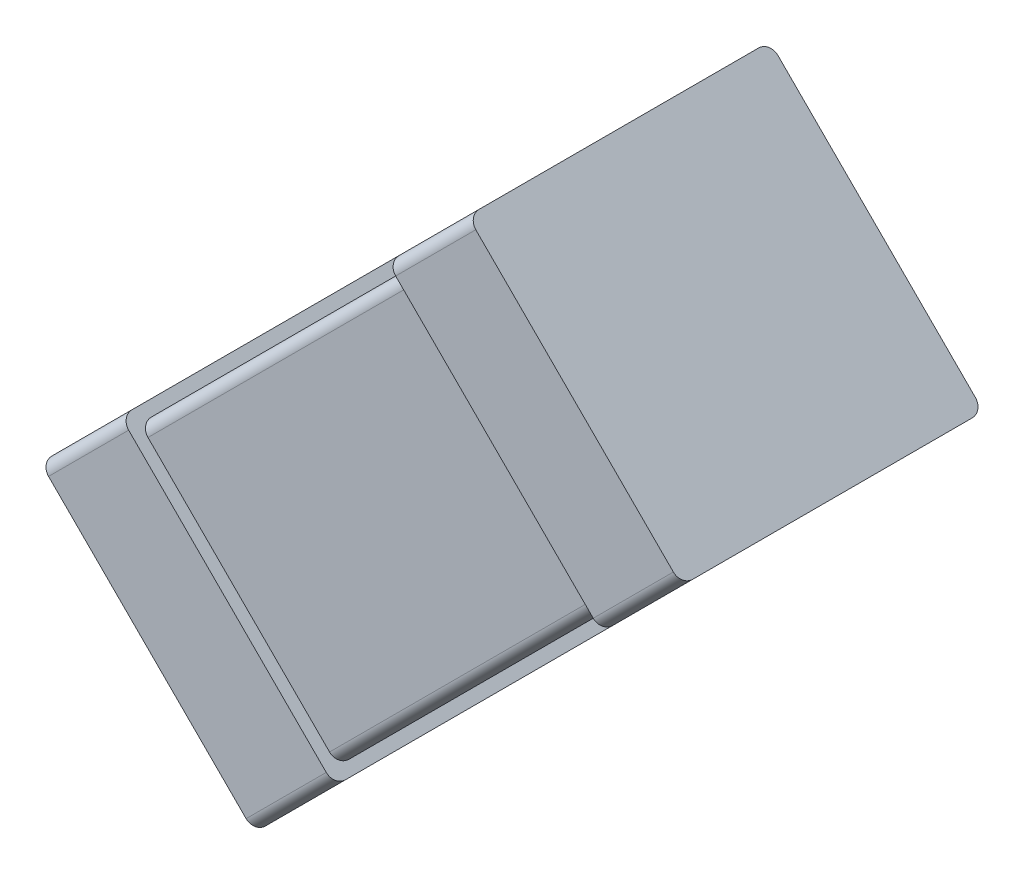
ISO-10303-21;
HEADER;
FILE_DESCRIPTION(('STEP AP214'),'2;1');
FILE_NAME('part.step','',(''),(''),'','','');
FILE_SCHEMA(('AUTOMOTIVE_DESIGN { 1 0 10303 214 1 1 1 1 }'));
ENDSEC;
DATA;
#1=APPLICATION_CONTEXT('core data for automotive mechanical design processes');
#2=APPLICATION_PROTOCOL_DEFINITION('international standard','automotive_design',2000,#1);
#3=PRODUCT_CONTEXT('',#1,'mechanical');
#4=PRODUCT('Part','Part','',(#3));
#5=PRODUCT_RELATED_PRODUCT_CATEGORY('part','',(#4));
#6=PRODUCT_DEFINITION_FORMATION('','',#4);
#7=PRODUCT_DEFINITION_CONTEXT('part definition',#1,'design');
#8=PRODUCT_DEFINITION('design','',#6,#7);
#9=PRODUCT_DEFINITION_SHAPE('','',#8);
#10=(LENGTH_UNIT() NAMED_UNIT(*) SI_UNIT(.MILLI.,.METRE.));
#11=(NAMED_UNIT(*) PLANE_ANGLE_UNIT() SI_UNIT($,.RADIAN.));
#12=(NAMED_UNIT(*) SI_UNIT($,.STERADIAN.) SOLID_ANGLE_UNIT());
#13=UNCERTAINTY_MEASURE_WITH_UNIT(LENGTH_MEASURE(1.E-05),#10,'distance_accuracy_value','');
#14=(GEOMETRIC_REPRESENTATION_CONTEXT(3) GLOBAL_UNCERTAINTY_ASSIGNED_CONTEXT((#13)) GLOBAL_UNIT_ASSIGNED_CONTEXT((#10,
#11,#12)) REPRESENTATION_CONTEXT('',''));
#15=CARTESIAN_POINT('',(0.,0.,0.));
#16=DIRECTION('',(0.,0.,1.));
#17=DIRECTION('',(1.,0.,0.));
#18=AXIS2_PLACEMENT_3D('',#15,#16,#17);
#19=CARTESIAN_POINT('',(174.127836142514,100.481820579876,112.211582908599));
#20=DIRECTION('',(-0.707106781186547,-0.707106781186548,0.));
#21=DIRECTION('',(-0.707106781186548,0.707106781186547,0.));
#22=AXIS2_PLACEMENT_3D('',#19,#20,#21);
#23=PLANE('',#22);
#24=DIRECTION('',(0.,0.,1.));
#25=VECTOR('',#24,1.);
#26=CARTESIAN_POINT('',(174.127836142514,100.481820579876,112.211582908599));
#27=LINE('',#26,#25);
#28=CARTESIAN_POINT('',(174.127836142514,100.481820579876,112.241582908599));
#29=VERTEX_POINT('',#28);
#30=CARTESIAN_POINT('',(174.127836142514,100.481820579876,112.981582908599));
#31=VERTEX_POINT('',#30);
#32=EDGE_CURVE('E48',#29,#31,#27,.T.);
#33=ORIENTED_EDGE('',*,*,#32,.F.);
#34=CARTESIAN_POINT('',(174.14904934595,100.46060737644,112.241582908599));
#35=DIRECTION('',(-0.707106781186547,-0.707106781186548,0.));
#36=DIRECTION('',(0.,0.,1.));
#37=AXIS2_PLACEMENT_3D('',#34,#35,#36);
#38=CIRCLE('',#37,0.0300000000000023);
#39=CARTESIAN_POINT('',(174.14904934595,100.46060737644,112.211582908599));
#40=VERTEX_POINT('',#39);
#41=EDGE_CURVE('E11',#29,#40,#38,.T.);
#42=ORIENTED_EDGE('',*,*,#41,.T.);
#43=DIRECTION('',(0.707106781186548,-0.707106781186547,0.));
#44=VECTOR('',#43,1.);
#45=CARTESIAN_POINT('',(174.127836142514,100.481820579876,112.211582908599));
#46=LINE('',#45,#44);
#47=CARTESIAN_POINT('',(174.672308364028,99.9373483583619,112.211582908599));
#48=VERTEX_POINT('',#47);
#49=EDGE_CURVE('E55',#40,#48,#46,.T.);
#50=ORIENTED_EDGE('',*,*,#49,.T.);
#51=CARTESIAN_POINT('',(174.672308364028,99.9373483583619,112.241582908599));
#52=DIRECTION('',(0.707106781186547,0.707106781186548,0.));
#53=DIRECTION('',(0.,0.,1.));
#54=AXIS2_PLACEMENT_3D('',#51,#52,#53);
#55=CIRCLE('',#54,0.0300000000000023);
#56=CARTESIAN_POINT('',(174.693521567464,99.9161351549263,112.241582908599));
#57=VERTEX_POINT('',#56);
#58=EDGE_CURVE('E303',#57,#48,#55,.T.);
#59=ORIENTED_EDGE('',*,*,#58,.F.);
#60=DIRECTION('',(0.,0.,1.));
#61=VECTOR('',#60,1.);
#62=CARTESIAN_POINT('',(174.693521567464,99.9161351549263,112.211582908599));
#63=LINE('',#62,#61);
#64=CARTESIAN_POINT('',(174.693521567464,99.9161351549263,112.981582908599));
#65=VERTEX_POINT('',#64);
#66=EDGE_CURVE('E330',#57,#65,#63,.T.);
#67=ORIENTED_EDGE('',*,*,#66,.T.);
#68=CARTESIAN_POINT('',(174.672308364028,99.9373483583619,112.981582908599));
#69=DIRECTION('',(-0.707106781186547,-0.707106781186548,0.));
#70=DIRECTION('',(0.,0.,1.));
#71=AXIS2_PLACEMENT_3D('',#68,#69,#70);
#72=CIRCLE('',#71,0.0300000000000023);
#73=CARTESIAN_POINT('',(174.672308364028,99.9373483583619,113.011582908599));
#74=VERTEX_POINT('',#73);
#75=EDGE_CURVE('E389',#65,#74,#72,.T.);
#76=ORIENTED_EDGE('',*,*,#75,.T.);
#77=DIRECTION('',(0.707106781186548,-0.707106781186547,0.));
#78=VECTOR('',#77,1.);
#79=CARTESIAN_POINT('',(174.127836142514,100.481820579876,113.011582908599));
#80=LINE('',#79,#78);
#81=CARTESIAN_POINT('',(174.14904934595,100.46060737644,113.011582908599));
#82=VERTEX_POINT('',#81);
#83=EDGE_CURVE('E105',#82,#74,#80,.T.);
#84=ORIENTED_EDGE('',*,*,#83,.F.);
#85=CARTESIAN_POINT('',(174.14904934595,100.46060737644,112.981582908599));
#86=DIRECTION('',(0.707106781186547,0.707106781186548,0.));
#87=DIRECTION('',(0.,0.,1.));
#88=AXIS2_PLACEMENT_3D('',#85,#86,#87);
#89=CIRCLE('',#88,0.0300000000000023);
#90=EDGE_CURVE('E121',#31,#82,#89,.T.);
#91=ORIENTED_EDGE('',*,*,#90,.F.);
#92=EDGE_LOOP('',(#33,#42,#50,#59,#67,#76,#84,#91));
#93=FACE_BOUND('',#92,.T.);
#94=ADVANCED_FACE('F44',(#93),#23,.T.);
#95=CARTESIAN_POINT('',(174.905653601819,100.128267189282,112.211582908599));
#96=DIRECTION('',(0.707106781186548,-0.707106781186547,0.));
#97=DIRECTION('',(0.,0.,-1.));
#98=AXIS2_PLACEMENT_3D('',#95,#96,#97);
#99=PLANE('',#98);
#100=ORIENTED_EDGE('',*,*,#66,.F.);
#101=DIRECTION('',(-0.707106781186547,-0.707106781186548,0.));
#102=VECTOR('',#101,1.);
#103=CARTESIAN_POINT('',(174.905653601819,100.128267189282,112.241582908599));
#104=LINE('',#103,#102);
#105=CARTESIAN_POINT('',(174.905653601819,100.128267189282,112.241582908599));
#106=VERTEX_POINT('',#105);
#107=EDGE_CURVE('E379',#106,#57,#104,.T.);
#108=ORIENTED_EDGE('',*,*,#107,.F.);
#109=DIRECTION('',(0.,0.,1.));
#110=VECTOR('',#109,1.);
#111=CARTESIAN_POINT('',(174.905653601819,100.128267189282,112.211582908599));
#112=LINE('',#111,#110);
#113=CARTESIAN_POINT('',(174.905653601819,100.128267189282,112.981582908599));
#114=VERTEX_POINT('',#113);
#115=EDGE_CURVE('E395',#106,#114,#112,.T.);
#116=ORIENTED_EDGE('',*,*,#115,.T.);
#117=DIRECTION('',(-0.707106781186547,-0.707106781186548,0.));
#118=VECTOR('',#117,1.);
#119=CARTESIAN_POINT('',(174.905653601819,100.128267189282,112.981582908599));
#120=LINE('',#119,#118);
#121=EDGE_CURVE('E402',#114,#65,#120,.T.);
#122=ORIENTED_EDGE('',*,*,#121,.T.);
#123=EDGE_LOOP('',(#100,#108,#116,#122));
#124=FACE_BOUND('',#123,.T.);
#125=ADVANCED_FACE('F557',(#124),#99,.T.);
#126=CARTESIAN_POINT('',(174.884440398384,100.149480392718,112.981582908599));
#127=DIRECTION('',(-0.707106781186548,-0.707106781186548,0.));
#128=DIRECTION('',(0.707106781186548,-0.707106781186548,0.));
#129=AXIS2_PLACEMENT_3D('',#126,#127,#128);
#130=CYLINDRICAL_SURFACE('',#129,0.0299999999999963);
#131=CARTESIAN_POINT('',(174.884440398384,100.149480392718,112.981582908599));
#132=DIRECTION('',(-0.707106781186547,-0.707106781186548,0.));
#133=DIRECTION('',(0.,0.,1.));
#134=AXIS2_PLACEMENT_3D('',#131,#132,#133);
#135=CIRCLE('',#134,0.0300000000000023);
#136=CARTESIAN_POINT('',(174.884440398384,100.149480392718,113.011582908599));
#137=VERTEX_POINT('',#136);
#138=EDGE_CURVE('E378',#114,#137,#135,.T.);
#139=ORIENTED_EDGE('',*,*,#138,.T.);
#140=DIRECTION('',(-0.707106781186547,-0.707106781186548,0.));
#141=VECTOR('',#140,1.);
#142=CARTESIAN_POINT('',(174.884440398384,100.149480392718,113.011582908599));
#143=LINE('',#142,#141);
#144=EDGE_CURVE('E374',#137,#74,#143,.T.);
#145=ORIENTED_EDGE('',*,*,#144,.T.);
#146=ORIENTED_EDGE('',*,*,#75,.F.);
#147=ORIENTED_EDGE('',*,*,#121,.F.);
#148=EDGE_LOOP('',(#139,#145,#146,#147));
#149=FACE_BOUND('',#148,.T.);
#150=ADVANCED_FACE('F553',(#149),#130,.T.);
#151=CARTESIAN_POINT('',(174.884440398384,100.149480392718,112.241582908599));
#152=DIRECTION('',(-0.707106781186548,-0.707106781186548,0.));
#153=DIRECTION('',(0.707106781186548,-0.707106781186548,0.));
#154=AXIS2_PLACEMENT_3D('',#151,#152,#153);
#155=CYLINDRICAL_SURFACE('',#154,0.0299999999999963);
#156=ORIENTED_EDGE('',*,*,#107,.T.);
#157=ORIENTED_EDGE('',*,*,#58,.T.);
#158=DIRECTION('',(-0.707106781186547,-0.707106781186548,0.));
#159=VECTOR('',#158,1.);
#160=CARTESIAN_POINT('',(174.884440398384,100.149480392718,112.211582908599));
#161=LINE('',#160,#159);
#162=CARTESIAN_POINT('',(174.884440398384,100.149480392718,112.211582908599));
#163=VERTEX_POINT('',#162);
#164=EDGE_CURVE('E292',#163,#48,#161,.T.);
#165=ORIENTED_EDGE('',*,*,#164,.F.);
#166=CARTESIAN_POINT('',(174.884440398384,100.149480392718,112.241582908599));
#167=DIRECTION('',(0.707106781186547,0.707106781186548,0.));
#168=DIRECTION('',(0.,0.,1.));
#169=AXIS2_PLACEMENT_3D('',#166,#167,#168);
#170=CIRCLE('',#169,0.0300000000000023);
#171=EDGE_CURVE('E266',#106,#163,#170,.T.);
#172=ORIENTED_EDGE('',*,*,#171,.F.);
#173=EDGE_LOOP('',(#156,#157,#165,#172));
#174=FACE_BOUND('',#173,.T.);
#175=ADVANCED_FACE('F559',(#174),#155,.T.);
#176=CARTESIAN_POINT('',(174.33996817687,100.693952614231,113.011582908599));
#177=DIRECTION('',(0.,0.,1.));
#178=DIRECTION('',(1.,0.,0.));
#179=AXIS2_PLACEMENT_3D('',#176,#177,#178);
#180=PLANE('',#179);
#181=DIRECTION('',(0.707106781186548,-0.707106781186547,0.));
#182=VECTOR('',#181,1.);
#183=CARTESIAN_POINT('',(174.33996817687,100.693952614231,113.011582908599));
#184=LINE('',#183,#182);
#185=CARTESIAN_POINT('',(174.361181380306,100.672739410796,113.011582908599));
#186=VERTEX_POINT('',#185);
#187=EDGE_CURVE('E261',#186,#137,#184,.T.);
#188=ORIENTED_EDGE('',*,*,#187,.F.);
#189=DIRECTION('',(-0.707106781186547,-0.707106781186548,0.));
#190=VECTOR('',#189,1.);
#191=CARTESIAN_POINT('',(174.361181380306,100.672739410796,113.011582908599));
#192=LINE('',#191,#190);
#193=EDGE_CURVE('E291',#186,#82,#192,.T.);
#194=ORIENTED_EDGE('',*,*,#193,.T.);
#195=ORIENTED_EDGE('',*,*,#83,.T.);
#196=ORIENTED_EDGE('',*,*,#144,.F.);
#197=EDGE_LOOP('',(#188,#194,#195,#196));
#198=FACE_BOUND('',#197,.T.);
#199=ADVANCED_FACE('F550',(#198),#180,.T.);
#200=CARTESIAN_POINT('',(174.33996817687,100.693952614231,112.211582908599));
#201=DIRECTION('',(0.,0.,1.));
#202=DIRECTION('',(1.,0.,0.));
#203=AXIS2_PLACEMENT_3D('',#200,#201,#202);
#204=PLANE('',#203);
#205=ORIENTED_EDGE('',*,*,#164,.T.);
#206=ORIENTED_EDGE('',*,*,#49,.F.);
#207=DIRECTION('',(-0.707106781186547,-0.707106781186548,0.));
#208=VECTOR('',#207,1.);
#209=CARTESIAN_POINT('',(174.361181380306,100.672739410796,112.211582908599));
#210=LINE('',#209,#208);
#211=CARTESIAN_POINT('',(174.361181380306,100.672739410796,112.211582908599));
#212=VERTEX_POINT('',#211);
#213=EDGE_CURVE('E282',#212,#40,#210,.T.);
#214=ORIENTED_EDGE('',*,*,#213,.F.);
#215=DIRECTION('',(0.707106781186548,-0.707106781186547,0.));
#216=VECTOR('',#215,1.);
#217=CARTESIAN_POINT('',(174.33996817687,100.693952614231,112.211582908599));
#218=LINE('',#217,#216);
#219=EDGE_CURVE('E369',#212,#163,#218,.T.);
#220=ORIENTED_EDGE('',*,*,#219,.T.);
#221=EDGE_LOOP('',(#205,#206,#214,#220));
#222=FACE_BOUND('',#221,.T.);
#223=ADVANCED_FACE('F562',(#222),#204,.F.);
#224=CARTESIAN_POINT('',(174.361181380306,100.672739410796,112.981582908599));
#225=DIRECTION('',(-0.707106781186548,-0.707106781186548,0.));
#226=DIRECTION('',(-0.707106781186548,0.707106781186548,0.));
#227=AXIS2_PLACEMENT_3D('',#224,#225,#226);
#228=CYLINDRICAL_SURFACE('',#227,0.0299999999999963);
#229=DIRECTION('',(-0.707106781186547,-0.707106781186548,0.));
#230=VECTOR('',#229,1.);
#231=CARTESIAN_POINT('',(174.33996817687,100.693952614231,112.981582908599));
#232=LINE('',#231,#230);
#233=CARTESIAN_POINT('',(174.33996817687,100.693952614231,112.981582908599));
#234=VERTEX_POINT('',#233);
#235=EDGE_CURVE('E259',#234,#31,#232,.T.);
#236=ORIENTED_EDGE('',*,*,#235,.T.);
#237=ORIENTED_EDGE('',*,*,#90,.T.);
#238=ORIENTED_EDGE('',*,*,#193,.F.);
#239=CARTESIAN_POINT('',(174.361181380306,100.672739410796,112.981582908599));
#240=DIRECTION('',(0.707106781186547,0.707106781186548,0.));
#241=DIRECTION('',(0.,0.,1.));
#242=AXIS2_PLACEMENT_3D('',#239,#240,#241);
#243=CIRCLE('',#242,0.0300000000000023);
#244=EDGE_CURVE('E265',#234,#186,#243,.T.);
#245=ORIENTED_EDGE('',*,*,#244,.F.);
#246=EDGE_LOOP('',(#236,#237,#238,#245));
#247=FACE_BOUND('',#246,.T.);
#248=ADVANCED_FACE('F548',(#247),#228,.T.);
#249=CARTESIAN_POINT('',(174.361181380306,100.672739410796,112.241582908599));
#250=DIRECTION('',(-0.707106781186548,-0.707106781186548,0.));
#251=DIRECTION('',(-0.707106781186548,0.707106781186548,0.));
#252=AXIS2_PLACEMENT_3D('',#249,#250,#251);
#253=CYLINDRICAL_SURFACE('',#252,0.0299999999999963);
#254=CARTESIAN_POINT('',(174.361181380306,100.672739410796,112.241582908599));
#255=DIRECTION('',(-0.707106781186547,-0.707106781186548,0.));
#256=DIRECTION('',(0.,0.,1.));
#257=AXIS2_PLACEMENT_3D('',#254,#255,#256);
#258=CIRCLE('',#257,0.0300000000000023);
#259=CARTESIAN_POINT('',(174.33996817687,100.693952614231,112.241582908599));
#260=VERTEX_POINT('',#259);
#261=EDGE_CURVE('E260',#260,#212,#258,.T.);
#262=ORIENTED_EDGE('',*,*,#261,.T.);
#263=ORIENTED_EDGE('',*,*,#213,.T.);
#264=ORIENTED_EDGE('',*,*,#41,.F.);
#265=DIRECTION('',(-0.707106781186547,-0.707106781186548,0.));
#266=VECTOR('',#265,1.);
#267=CARTESIAN_POINT('',(174.33996817687,100.693952614231,112.241582908599));
#268=LINE('',#267,#266);
#269=EDGE_CURVE('E304',#260,#29,#268,.T.);
#270=ORIENTED_EDGE('',*,*,#269,.F.);
#271=EDGE_LOOP('',(#262,#263,#264,#270));
#272=FACE_BOUND('',#271,.T.);
#273=ADVANCED_FACE('F544',(#272),#253,.T.);
#274=CARTESIAN_POINT('',(174.33996817687,100.693952614231,112.211582908599));
#275=DIRECTION('',(0.707106781186548,-0.707106781186547,0.));
#276=DIRECTION('',(0.,0.,-1.));
#277=AXIS2_PLACEMENT_3D('',#274,#275,#276);
#278=PLANE('',#277);
#279=ORIENTED_EDGE('',*,*,#235,.F.);
#280=DIRECTION('',(0.,0.,1.));
#281=VECTOR('',#280,1.);
#282=CARTESIAN_POINT('',(174.33996817687,100.693952614231,112.211582908599));
#283=LINE('',#282,#281);
#284=EDGE_CURVE('E449',#260,#234,#283,.T.);
#285=ORIENTED_EDGE('',*,*,#284,.F.);
#286=ORIENTED_EDGE('',*,*,#269,.T.);
#287=ORIENTED_EDGE('',*,*,#32,.T.);
#288=EDGE_LOOP('',(#279,#285,#286,#287));
#289=FACE_BOUND('',#288,.T.);
#290=ADVANCED_FACE('F547',(#289),#278,.F.);
#291=CARTESIAN_POINT('',(174.33996817687,100.693952614231,112.211582908599));
#292=DIRECTION('',(-0.707106781186547,-0.707106781186548,0.));
#293=DIRECTION('',(-0.707106781186548,0.707106781186547,0.));
#294=AXIS2_PLACEMENT_3D('',#291,#292,#293);
#295=PLANE('',#294);
#296=ORIENTED_EDGE('',*,*,#244,.T.);
#297=ORIENTED_EDGE('',*,*,#187,.T.);
#298=ORIENTED_EDGE('',*,*,#138,.F.);
#299=ORIENTED_EDGE('',*,*,#115,.F.);
#300=ORIENTED_EDGE('',*,*,#171,.T.);
#301=ORIENTED_EDGE('',*,*,#219,.F.);
#302=ORIENTED_EDGE('',*,*,#261,.F.);
#303=ORIENTED_EDGE('',*,*,#284,.T.);
#304=EDGE_LOOP('',(#296,#297,#298,#299,#300,#301,#302,#303));
#305=FACE_BOUND('',#304,.T.);
#306=DIRECTION('',(0.707106781186548,-0.707106781186547,0.));
#307=VECTOR('',#306,1.);
#308=CARTESIAN_POINT('',(174.361181380306,100.672739410796,112.241582908599));
#309=LINE('',#308,#307);
#310=CARTESIAN_POINT('',(174.382394583742,100.65152620736,112.241582908599));
#311=VERTEX_POINT('',#310);
#312=CARTESIAN_POINT('',(174.863227194948,100.170693596153,112.241582908599));
#313=VERTEX_POINT('',#312);
#314=EDGE_CURVE('E446',#311,#313,#309,.T.);
#315=ORIENTED_EDGE('',*,*,#314,.T.);
#316=CARTESIAN_POINT('',(174.863227194948,100.170693596153,112.271582908599));
#317=DIRECTION('',(0.707106781186547,0.707106781186548,0.));
#318=DIRECTION('',(0.,0.,1.));
#319=AXIS2_PLACEMENT_3D('',#316,#317,#318);
#320=CIRCLE('',#319,0.0300000000000023);
#321=CARTESIAN_POINT('',(174.884440398384,100.149480392718,112.271582908599));
#322=VERTEX_POINT('',#321);
#323=EDGE_CURVE('E315',#322,#313,#320,.T.);
#324=ORIENTED_EDGE('',*,*,#323,.F.);
#325=DIRECTION('',(0.,0.,1.));
#326=VECTOR('',#325,1.);
#327=CARTESIAN_POINT('',(174.884440398384,100.149480392718,112.241582908599));
#328=LINE('',#327,#326);
#329=CARTESIAN_POINT('',(174.884440398384,100.149480392718,112.951582908599));
#330=VERTEX_POINT('',#329);
#331=EDGE_CURVE('E434',#322,#330,#328,.T.);
#332=ORIENTED_EDGE('',*,*,#331,.T.);
#333=CARTESIAN_POINT('',(174.863227194948,100.170693596153,112.951582908599));
#334=DIRECTION('',(-0.707106781186547,-0.707106781186548,0.));
#335=DIRECTION('',(0.,0.,1.));
#336=AXIS2_PLACEMENT_3D('',#333,#334,#335);
#337=CIRCLE('',#336,0.0300000000000023);
#338=CARTESIAN_POINT('',(174.863227194948,100.170693596153,112.981582908599));
#339=VERTEX_POINT('',#338);
#340=EDGE_CURVE('E228',#330,#339,#337,.T.);
#341=ORIENTED_EDGE('',*,*,#340,.T.);
#342=DIRECTION('',(0.707106781186548,-0.707106781186547,0.));
#343=VECTOR('',#342,1.);
#344=CARTESIAN_POINT('',(174.361181380306,100.672739410796,112.981582908599));
#345=LINE('',#344,#343);
#346=CARTESIAN_POINT('',(174.382394583742,100.65152620736,112.981582908599));
#347=VERTEX_POINT('',#346);
#348=EDGE_CURVE('E222',#347,#339,#345,.T.);
#349=ORIENTED_EDGE('',*,*,#348,.F.);
#350=CARTESIAN_POINT('',(174.382394583742,100.65152620736,112.951582908599));
#351=DIRECTION('',(0.707106781186547,0.707106781186548,0.));
#352=DIRECTION('',(0.,0.,1.));
#353=AXIS2_PLACEMENT_3D('',#350,#351,#352);
#354=CIRCLE('',#353,0.0300000000000023);
#355=CARTESIAN_POINT('',(174.361181380306,100.672739410796,112.951582908599));
#356=VERTEX_POINT('',#355);
#357=EDGE_CURVE('E225',#356,#347,#354,.T.);
#358=ORIENTED_EDGE('',*,*,#357,.F.);
#359=DIRECTION('',(0.,0.,1.));
#360=VECTOR('',#359,1.);
#361=CARTESIAN_POINT('',(174.361181380306,100.672739410796,112.241582908599));
#362=LINE('',#361,#360);
#363=CARTESIAN_POINT('',(174.361181380306,100.672739410796,112.271582908599));
#364=VERTEX_POINT('',#363);
#365=EDGE_CURVE('E195',#364,#356,#362,.T.);
#366=ORIENTED_EDGE('',*,*,#365,.F.);
#367=CARTESIAN_POINT('',(174.382394583742,100.65152620736,112.271582908599));
#368=DIRECTION('',(-0.707106781186547,-0.707106781186548,0.));
#369=DIRECTION('',(0.,0.,1.));
#370=AXIS2_PLACEMENT_3D('',#367,#368,#369);
#371=CIRCLE('',#370,0.0300000000000023);
#372=EDGE_CURVE('E205',#364,#311,#371,.T.);
#373=ORIENTED_EDGE('',*,*,#372,.T.);
#374=EDGE_LOOP('',(#315,#324,#332,#341,#349,#358,#366,#373));
#375=FACE_BOUND('',#374,.T.);
#376=ADVANCED_FACE('F224',(#305,#375),#295,.F.);
#377=CARTESIAN_POINT('',(175.068288161492,101.379846191982,112.241582908599));
#378=DIRECTION('',(0.707106781186548,-0.707106781186547,0.));
#379=DIRECTION('',(0.,0.,-1.));
#380=AXIS2_PLACEMENT_3D('',#377,#378,#379);
#381=PLANE('',#380);
#382=DIRECTION('',(-0.707106781186547,-0.707106781186548,0.));
#383=VECTOR('',#382,1.);
#384=CARTESIAN_POINT('',(175.068288161492,101.379846191982,112.951582908599));
#385=LINE('',#384,#383);
#386=CARTESIAN_POINT('',(175.068288161492,101.379846191982,112.951582908599));
#387=VERTEX_POINT('',#386);
#388=EDGE_CURVE('E243',#387,#356,#385,.T.);
#389=ORIENTED_EDGE('',*,*,#388,.F.);
#390=DIRECTION('',(0.,0.,1.));
#391=VECTOR('',#390,1.);
#392=CARTESIAN_POINT('',(175.068288161492,101.379846191982,112.241582908599));
#393=LINE('',#392,#391);
#394=CARTESIAN_POINT('',(175.068288161492,101.379846191982,112.271582908599));
#395=VERTEX_POINT('',#394);
#396=EDGE_CURVE('E322',#395,#387,#393,.T.);
#397=ORIENTED_EDGE('',*,*,#396,.F.);
#398=DIRECTION('',(-0.707106781186547,-0.707106781186548,0.));
#399=VECTOR('',#398,1.);
#400=CARTESIAN_POINT('',(175.068288161492,101.379846191982,112.271582908599));
#401=LINE('',#400,#399);
#402=EDGE_CURVE('E333',#395,#364,#401,.T.);
#403=ORIENTED_EDGE('',*,*,#402,.T.);
#404=ORIENTED_EDGE('',*,*,#365,.T.);
#405=EDGE_LOOP('',(#389,#397,#403,#404));
#406=FACE_BOUND('',#405,.T.);
#407=ADVANCED_FACE('F634',(#406),#381,.F.);
#408=CARTESIAN_POINT('',(175.089501364928,101.358632988547,112.951582908599));
#409=DIRECTION('',(-0.707106781186548,-0.707106781186548,0.));
#410=DIRECTION('',(-0.707106781186548,0.707106781186548,0.));
#411=AXIS2_PLACEMENT_3D('',#408,#409,#410);
#412=CYLINDRICAL_SURFACE('',#411,0.0299999999999963);
#413=ORIENTED_EDGE('',*,*,#388,.T.);
#414=ORIENTED_EDGE('',*,*,#357,.T.);
#415=DIRECTION('',(-0.707106781186547,-0.707106781186548,0.));
#416=VECTOR('',#415,1.);
#417=CARTESIAN_POINT('',(175.089501364928,101.358632988547,112.981582908599));
#418=LINE('',#417,#416);
#419=CARTESIAN_POINT('',(175.089501364928,101.358632988547,112.981582908599));
#420=VERTEX_POINT('',#419);
#421=EDGE_CURVE('E234',#420,#347,#418,.T.);
#422=ORIENTED_EDGE('',*,*,#421,.F.);
#423=CARTESIAN_POINT('',(175.089501364928,101.358632988547,112.951582908599));
#424=DIRECTION('',(0.707106781186547,0.707106781186548,0.));
#425=DIRECTION('',(0.,0.,1.));
#426=AXIS2_PLACEMENT_3D('',#423,#424,#425);
#427=CIRCLE('',#426,0.0300000000000023);
#428=EDGE_CURVE('E295',#387,#420,#427,.T.);
#429=ORIENTED_EDGE('',*,*,#428,.F.);
#430=EDGE_LOOP('',(#413,#414,#422,#429));
#431=FACE_BOUND('',#430,.T.);
#432=ADVANCED_FACE('F239',(#431),#412,.T.);
#433=CARTESIAN_POINT('',(175.068288161492,101.379846191982,112.981582908599));
#434=DIRECTION('',(0.,0.,1.));
#435=DIRECTION('',(1.,0.,0.));
#436=AXIS2_PLACEMENT_3D('',#433,#434,#435);
#437=PLANE('',#436);
#438=DIRECTION('',(0.707106781186548,-0.707106781186547,0.));
#439=VECTOR('',#438,1.);
#440=CARTESIAN_POINT('',(175.068288161492,101.379846191982,112.981582908599));
#441=LINE('',#440,#439);
#442=CARTESIAN_POINT('',(175.570333976134,100.87780037734,112.981582908599));
#443=VERTEX_POINT('',#442);
#444=EDGE_CURVE('E248',#420,#443,#441,.T.);
#445=ORIENTED_EDGE('',*,*,#444,.F.);
#446=ORIENTED_EDGE('',*,*,#421,.T.);
#447=ORIENTED_EDGE('',*,*,#348,.T.);
#448=DIRECTION('',(-0.707106781186547,-0.707106781186548,0.));
#449=VECTOR('',#448,1.);
#450=CARTESIAN_POINT('',(175.570333976134,100.87780037734,112.981582908599));
#451=LINE('',#450,#449);
#452=EDGE_CURVE('E287',#443,#339,#451,.T.);
#453=ORIENTED_EDGE('',*,*,#452,.F.);
#454=EDGE_LOOP('',(#445,#446,#447,#453));
#455=FACE_BOUND('',#454,.T.);
#456=ADVANCED_FACE('F246',(#455),#437,.T.);
#457=CARTESIAN_POINT('',(175.570333976134,100.87780037734,112.951582908599));
#458=DIRECTION('',(-0.707106781186548,-0.707106781186548,0.));
#459=DIRECTION('',(0.707106781186548,-0.707106781186548,0.));
#460=AXIS2_PLACEMENT_3D('',#457,#458,#459);
#461=CYLINDRICAL_SURFACE('',#460,0.0299999999999963);
#462=CARTESIAN_POINT('',(175.570333976134,100.87780037734,112.951582908599));
#463=DIRECTION('',(-0.707106781186547,-0.707106781186548,0.));
#464=DIRECTION('',(0.,0.,1.));
#465=AXIS2_PLACEMENT_3D('',#462,#463,#464);
#466=CIRCLE('',#465,0.0300000000000023);
#467=CARTESIAN_POINT('',(175.59154717957,100.856587173904,112.951582908599));
#468=VERTEX_POINT('',#467);
#469=EDGE_CURVE('E235',#468,#443,#466,.T.);
#470=ORIENTED_EDGE('',*,*,#469,.T.);
#471=ORIENTED_EDGE('',*,*,#452,.T.);
#472=ORIENTED_EDGE('',*,*,#340,.F.);
#473=DIRECTION('',(-0.707106781186547,-0.707106781186548,0.));
#474=VECTOR('',#473,1.);
#475=CARTESIAN_POINT('',(175.59154717957,100.856587173904,112.951582908599));
#476=LINE('',#475,#474);
#477=EDGE_CURVE('E288',#468,#330,#476,.T.);
#478=ORIENTED_EDGE('',*,*,#477,.F.);
#479=EDGE_LOOP('',(#470,#471,#472,#478));
#480=FACE_BOUND('',#479,.T.);
#481=ADVANCED_FACE('F517',(#480),#461,.T.);
#482=CARTESIAN_POINT('',(175.59154717957,100.856587173904,112.241582908599));
#483=DIRECTION('',(0.707106781186548,-0.707106781186547,0.));
#484=DIRECTION('',(0.,0.,-1.));
#485=AXIS2_PLACEMENT_3D('',#482,#483,#484);
#486=PLANE('',#485);
#487=ORIENTED_EDGE('',*,*,#331,.F.);
#488=DIRECTION('',(-0.707106781186547,-0.707106781186548,0.));
#489=VECTOR('',#488,1.);
#490=CARTESIAN_POINT('',(175.59154717957,100.856587173904,112.271582908599));
#491=LINE('',#490,#489);
#492=CARTESIAN_POINT('',(175.59154717957,100.856587173904,112.271582908599));
#493=VERTEX_POINT('',#492);
#494=EDGE_CURVE('E350',#493,#322,#491,.T.);
#495=ORIENTED_EDGE('',*,*,#494,.F.);
#496=DIRECTION('',(0.,0.,1.));
#497=VECTOR('',#496,1.);
#498=CARTESIAN_POINT('',(175.59154717957,100.856587173904,112.241582908599));
#499=LINE('',#498,#497);
#500=EDGE_CURVE('E283',#493,#468,#499,.T.);
#501=ORIENTED_EDGE('',*,*,#500,.T.);
#502=ORIENTED_EDGE('',*,*,#477,.T.);
#503=EDGE_LOOP('',(#487,#495,#501,#502));
#504=FACE_BOUND('',#503,.T.);
#505=ADVANCED_FACE('F510',(#504),#486,.T.);
#506=CARTESIAN_POINT('',(175.570333976134,100.87780037734,112.271582908599));
#507=DIRECTION('',(-0.707106781186548,-0.707106781186548,0.));
#508=DIRECTION('',(0.707106781186548,-0.707106781186548,0.));
#509=AXIS2_PLACEMENT_3D('',#506,#507,#508);
#510=CYLINDRICAL_SURFACE('',#509,0.0299999999999963);
#511=ORIENTED_EDGE('',*,*,#494,.T.);
#512=ORIENTED_EDGE('',*,*,#323,.T.);
#513=DIRECTION('',(-0.707106781186547,-0.707106781186548,0.));
#514=VECTOR('',#513,1.);
#515=CARTESIAN_POINT('',(175.570333976134,100.87780037734,112.241582908599));
#516=LINE('',#515,#514);
#517=CARTESIAN_POINT('',(175.570333976134,100.87780037734,112.241582908599));
#518=VERTEX_POINT('',#517);
#519=EDGE_CURVE('E311',#518,#313,#516,.T.);
#520=ORIENTED_EDGE('',*,*,#519,.F.);
#521=CARTESIAN_POINT('',(175.570333976134,100.87780037734,112.271582908599));
#522=DIRECTION('',(0.707106781186547,0.707106781186548,0.));
#523=DIRECTION('',(0.,0.,1.));
#524=AXIS2_PLACEMENT_3D('',#521,#522,#523);
#525=CIRCLE('',#524,0.0300000000000023);
#526=EDGE_CURVE('E296',#493,#518,#525,.T.);
#527=ORIENTED_EDGE('',*,*,#526,.F.);
#528=EDGE_LOOP('',(#511,#512,#520,#527));
#529=FACE_BOUND('',#528,.T.);
#530=ADVANCED_FACE('F505',(#529),#510,.T.);
#531=CARTESIAN_POINT('',(175.068288161492,101.379846191982,112.241582908599));
#532=DIRECTION('',(0.,0.,1.));
#533=DIRECTION('',(1.,0.,0.));
#534=AXIS2_PLACEMENT_3D('',#531,#532,#533);
#535=PLANE('',#534);
#536=ORIENTED_EDGE('',*,*,#519,.T.);
#537=ORIENTED_EDGE('',*,*,#314,.F.);
#538=DIRECTION('',(-0.707106781186547,-0.707106781186548,0.));
#539=VECTOR('',#538,1.);
#540=CARTESIAN_POINT('',(175.089501364928,101.358632988547,112.241582908599));
#541=LINE('',#540,#539);
#542=CARTESIAN_POINT('',(175.089501364928,101.358632988547,112.241582908599));
#543=VERTEX_POINT('',#542);
#544=EDGE_CURVE('E347',#543,#311,#541,.T.);
#545=ORIENTED_EDGE('',*,*,#544,.F.);
#546=DIRECTION('',(0.707106781186548,-0.707106781186547,0.));
#547=VECTOR('',#546,1.);
#548=CARTESIAN_POINT('',(175.068288161492,101.379846191982,112.241582908599));
#549=LINE('',#548,#547);
#550=EDGE_CURVE('E316',#543,#518,#549,.T.);
#551=ORIENTED_EDGE('',*,*,#550,.T.);
#552=EDGE_LOOP('',(#536,#537,#545,#551));
#553=FACE_BOUND('',#552,.T.);
#554=ADVANCED_FACE('F46',(#553),#535,.F.);
#555=CARTESIAN_POINT('',(175.089501364928,101.358632988547,112.271582908599));
#556=DIRECTION('',(-0.707106781186548,-0.707106781186548,0.));
#557=DIRECTION('',(-0.707106781186548,0.707106781186548,0.));
#558=AXIS2_PLACEMENT_3D('',#555,#556,#557);
#559=CYLINDRICAL_SURFACE('',#558,0.0299999999999963);
#560=CARTESIAN_POINT('',(175.089501364928,101.358632988547,112.271582908599));
#561=DIRECTION('',(-0.707106781186547,-0.707106781186548,0.));
#562=DIRECTION('',(0.,0.,1.));
#563=AXIS2_PLACEMENT_3D('',#560,#561,#562);
#564=CIRCLE('',#563,0.0300000000000023);
#565=EDGE_CURVE('E461',#395,#543,#564,.T.);
#566=ORIENTED_EDGE('',*,*,#565,.T.);
#567=ORIENTED_EDGE('',*,*,#544,.T.);
#568=ORIENTED_EDGE('',*,*,#372,.F.);
#569=ORIENTED_EDGE('',*,*,#402,.F.);
#570=EDGE_LOOP('',(#566,#567,#568,#569));
#571=FACE_BOUND('',#570,.T.);
#572=ADVANCED_FACE('F591',(#571),#559,.T.);
#573=CARTESIAN_POINT('',(175.047074958056,101.401059395418,112.211582908599));
#574=DIRECTION('',(-0.707106781186547,-0.707106781186548,0.));
#575=DIRECTION('',(-0.707106781186548,0.707106781186547,0.));
#576=AXIS2_PLACEMENT_3D('',#573,#574,#575);
#577=PLANE('',#576);
#578=DIRECTION('',(0.,0.,1.));
#579=VECTOR('',#578,1.);
#580=CARTESIAN_POINT('',(175.047074958056,101.401059395418,112.211582908599));
#581=LINE('',#580,#579);
#582=CARTESIAN_POINT('',(175.047074958056,101.401059395418,112.241582908599));
#583=VERTEX_POINT('',#582);
#584=CARTESIAN_POINT('',(175.047074958056,101.401059395418,112.981582908599));
#585=VERTEX_POINT('',#584);
#586=EDGE_CURVE('E277',#583,#585,#581,.T.);
#587=ORIENTED_EDGE('',*,*,#586,.F.);
#588=CARTESIAN_POINT('',(175.068288161492,101.379846191982,112.241582908599));
#589=DIRECTION('',(-0.707106781186547,-0.707106781186548,0.));
#590=DIRECTION('',(0.,0.,1.));
#591=AXIS2_PLACEMENT_3D('',#588,#589,#590);
#592=CIRCLE('',#591,0.0300000000000023);
#593=CARTESIAN_POINT('',(175.068288161492,101.379846191982,112.211582908599));
#594=VERTEX_POINT('',#593);
#595=EDGE_CURVE('E343',#583,#594,#592,.T.);
#596=ORIENTED_EDGE('',*,*,#595,.T.);
#597=DIRECTION('',(0.707106781186548,-0.707106781186547,0.));
#598=VECTOR('',#597,1.);
#599=CARTESIAN_POINT('',(175.047074958056,101.401059395418,112.211582908599));
#600=LINE('',#599,#598);
#601=CARTESIAN_POINT('',(175.59154717957,100.856587173904,112.211582908599));
#602=VERTEX_POINT('',#601);
#603=EDGE_CURVE('E326',#594,#602,#600,.T.);
#604=ORIENTED_EDGE('',*,*,#603,.T.);
#605=CARTESIAN_POINT('',(175.59154717957,100.856587173904,112.241582908599));
#606=DIRECTION('',(0.707106781186547,0.707106781186548,0.));
#607=DIRECTION('',(0.,0.,1.));
#608=AXIS2_PLACEMENT_3D('',#605,#606,#607);
#609=CIRCLE('',#608,0.0300000000000023);
#610=CARTESIAN_POINT('',(175.612760383006,100.835373970469,112.241582908599));
#611=VERTEX_POINT('',#610);
#612=EDGE_CURVE('E272',#611,#602,#609,.T.);
#613=ORIENTED_EDGE('',*,*,#612,.F.);
#614=DIRECTION('',(0.,0.,1.));
#615=VECTOR('',#614,1.);
#616=CARTESIAN_POINT('',(175.612760383006,100.835373970469,112.211582908599));
#617=LINE('',#616,#615);
#618=CARTESIAN_POINT('',(175.612760383006,100.835373970469,112.981582908599));
#619=VERTEX_POINT('',#618);
#620=EDGE_CURVE('E321',#611,#619,#617,.T.);
#621=ORIENTED_EDGE('',*,*,#620,.T.);
#622=CARTESIAN_POINT('',(175.59154717957,100.856587173904,112.981582908599));
#623=DIRECTION('',(-0.707106781186547,-0.707106781186548,0.));
#624=DIRECTION('',(0.,0.,1.));
#625=AXIS2_PLACEMENT_3D('',#622,#623,#624);
#626=CIRCLE('',#625,0.0300000000000023);
#627=CARTESIAN_POINT('',(175.59154717957,100.856587173904,113.011582908599));
#628=VERTEX_POINT('',#627);
#629=EDGE_CURVE('E317',#619,#628,#626,.T.);
#630=ORIENTED_EDGE('',*,*,#629,.T.);
#631=DIRECTION('',(0.707106781186548,-0.707106781186547,0.));
#632=VECTOR('',#631,1.);
#633=CARTESIAN_POINT('',(175.047074958056,101.401059395418,113.011582908599));
#634=LINE('',#633,#632);
#635=CARTESIAN_POINT('',(175.068288161492,101.379846191982,113.011582908599));
#636=VERTEX_POINT('',#635);
#637=EDGE_CURVE('E414',#636,#628,#634,.T.);
#638=ORIENTED_EDGE('',*,*,#637,.F.);
#639=CARTESIAN_POINT('',(175.068288161492,101.379846191982,112.981582908599));
#640=DIRECTION('',(0.707106781186547,0.707106781186548,0.));
#641=DIRECTION('',(0.,0.,1.));
#642=AXIS2_PLACEMENT_3D('',#639,#640,#641);
#643=CIRCLE('',#642,0.0300000000000023);
#644=EDGE_CURVE('E334',#585,#636,#643,.T.);
#645=ORIENTED_EDGE('',*,*,#644,.F.);
#646=EDGE_LOOP('',(#587,#596,#604,#613,#621,#630,#638,#645));
#647=FACE_BOUND('',#646,.T.);
#648=ORIENTED_EDGE('',*,*,#565,.F.);
#649=ORIENTED_EDGE('',*,*,#396,.T.);
#650=ORIENTED_EDGE('',*,*,#428,.T.);
#651=ORIENTED_EDGE('',*,*,#444,.T.);
#652=ORIENTED_EDGE('',*,*,#469,.F.);
#653=ORIENTED_EDGE('',*,*,#500,.F.);
#654=ORIENTED_EDGE('',*,*,#526,.T.);
#655=ORIENTED_EDGE('',*,*,#550,.F.);
#656=EDGE_LOOP('',(#648,#649,#650,#651,#652,#653,#654,#655));
#657=FACE_BOUND('',#656,.T.);
#658=ADVANCED_FACE('F514',(#647,#657),#577,.T.);
#659=CARTESIAN_POINT('',(175.824892417362,101.047506004825,112.211582908599));
#660=DIRECTION('',(0.707106781186548,-0.707106781186547,0.));
#661=DIRECTION('',(0.,0.,-1.));
#662=AXIS2_PLACEMENT_3D('',#659,#660,#661);
#663=PLANE('',#662);
#664=ORIENTED_EDGE('',*,*,#620,.F.);
#665=DIRECTION('',(-0.707106781186547,-0.707106781186548,0.));
#666=VECTOR('',#665,1.);
#667=CARTESIAN_POINT('',(175.824892417362,101.047506004825,112.241582908599));
#668=LINE('',#667,#666);
#669=CARTESIAN_POINT('',(175.824892417362,101.047506004825,112.241582908599));
#670=VERTEX_POINT('',#669);
#671=EDGE_CURVE('E267',#670,#611,#668,.T.);
#672=ORIENTED_EDGE('',*,*,#671,.F.);
#673=DIRECTION('',(0.,0.,1.));
#674=VECTOR('',#673,1.);
#675=CARTESIAN_POINT('',(175.824892417362,101.047506004825,112.211582908599));
#676=LINE('',#675,#674);
#677=CARTESIAN_POINT('',(175.824892417362,101.047506004825,112.981582908599));
#678=VERTEX_POINT('',#677);
#679=EDGE_CURVE('E359',#670,#678,#676,.T.);
#680=ORIENTED_EDGE('',*,*,#679,.T.);
#681=DIRECTION('',(-0.707106781186547,-0.707106781186548,0.));
#682=VECTOR('',#681,1.);
#683=CARTESIAN_POINT('',(175.824892417362,101.047506004825,112.981582908599));
#684=LINE('',#683,#682);
#685=EDGE_CURVE('E363',#678,#619,#684,.T.);
#686=ORIENTED_EDGE('',*,*,#685,.T.);
#687=EDGE_LOOP('',(#664,#672,#680,#686));
#688=FACE_BOUND('',#687,.T.);
#689=ADVANCED_FACE('F612',(#688),#663,.T.);
#690=CARTESIAN_POINT('',(175.803679213927,101.06871920826,112.981582908599));
#691=DIRECTION('',(-0.707106781186548,-0.707106781186548,0.));
#692=DIRECTION('',(0.707106781186548,-0.707106781186548,0.));
#693=AXIS2_PLACEMENT_3D('',#690,#691,#692);
#694=CYLINDRICAL_SURFACE('',#693,0.0299999999999963);
#695=CARTESIAN_POINT('',(175.803679213927,101.06871920826,112.981582908599));
#696=DIRECTION('',(-0.707106781186547,-0.707106781186548,0.));
#697=DIRECTION('',(0.,0.,1.));
#698=AXIS2_PLACEMENT_3D('',#695,#696,#697);
#699=CIRCLE('',#698,0.0300000000000023);
#700=CARTESIAN_POINT('',(175.803679213927,101.06871920826,113.011582908599));
#701=VERTEX_POINT('',#700);
#702=EDGE_CURVE('E370',#678,#701,#699,.T.);
#703=ORIENTED_EDGE('',*,*,#702,.T.);
#704=DIRECTION('',(-0.707106781186547,-0.707106781186548,0.));
#705=VECTOR('',#704,1.);
#706=CARTESIAN_POINT('',(175.803679213927,101.06871920826,113.011582908599));
#707=LINE('',#706,#705);
#708=EDGE_CURVE('E271',#701,#628,#707,.T.);
#709=ORIENTED_EDGE('',*,*,#708,.T.);
#710=ORIENTED_EDGE('',*,*,#629,.F.);
#711=ORIENTED_EDGE('',*,*,#685,.F.);
#712=EDGE_LOOP('',(#703,#709,#710,#711));
#713=FACE_BOUND('',#712,.T.);
#714=ADVANCED_FACE('F675',(#713),#694,.T.);
#715=CARTESIAN_POINT('',(175.803679213927,101.06871920826,112.241582908599));
#716=DIRECTION('',(-0.707106781186548,-0.707106781186548,0.));
#717=DIRECTION('',(0.707106781186548,-0.707106781186548,0.));
#718=AXIS2_PLACEMENT_3D('',#715,#716,#717);
#719=CYLINDRICAL_SURFACE('',#718,0.0299999999999963);
#720=ORIENTED_EDGE('',*,*,#671,.T.);
#721=ORIENTED_EDGE('',*,*,#612,.T.);
#722=DIRECTION('',(-0.707106781186547,-0.707106781186548,0.));
#723=VECTOR('',#722,1.);
#724=CARTESIAN_POINT('',(175.803679213927,101.06871920826,112.211582908599));
#725=LINE('',#724,#723);
#726=CARTESIAN_POINT('',(175.803679213927,101.06871920826,112.211582908599));
#727=VERTEX_POINT('',#726);
#728=EDGE_CURVE('E256',#727,#602,#725,.T.);
#729=ORIENTED_EDGE('',*,*,#728,.F.);
#730=CARTESIAN_POINT('',(175.803679213927,101.06871920826,112.241582908599));
#731=DIRECTION('',(0.707106781186547,0.707106781186548,0.));
#732=DIRECTION('',(0.,0.,1.));
#733=AXIS2_PLACEMENT_3D('',#730,#731,#732);
#734=CIRCLE('',#733,0.0300000000000023);
#735=EDGE_CURVE('E297',#670,#727,#734,.T.);
#736=ORIENTED_EDGE('',*,*,#735,.F.);
#737=EDGE_LOOP('',(#720,#721,#729,#736));
#738=FACE_BOUND('',#737,.T.);
#739=ADVANCED_FACE('F808',(#738),#719,.T.);
#740=CARTESIAN_POINT('',(175.259206992412,101.613191429774,113.011582908599));
#741=DIRECTION('',(0.,0.,1.));
#742=DIRECTION('',(1.,0.,0.));
#743=AXIS2_PLACEMENT_3D('',#740,#741,#742);
#744=PLANE('',#743);
#745=DIRECTION('',(0.707106781186548,-0.707106781186547,0.));
#746=VECTOR('',#745,1.);
#747=CARTESIAN_POINT('',(175.259206992412,101.613191429774,113.011582908599));
#748=LINE('',#747,#746);
#749=CARTESIAN_POINT('',(175.280420195848,101.591978226338,113.011582908599));
#750=VERTEX_POINT('',#749);
#751=EDGE_CURVE('E278',#750,#701,#748,.T.);
#752=ORIENTED_EDGE('',*,*,#751,.F.);
#753=DIRECTION('',(-0.707106781186547,-0.707106781186548,0.));
#754=VECTOR('',#753,1.);
#755=CARTESIAN_POINT('',(175.280420195848,101.591978226338,113.011582908599));
#756=LINE('',#755,#754);
#757=EDGE_CURVE('E410',#750,#636,#756,.T.);
#758=ORIENTED_EDGE('',*,*,#757,.T.);
#759=ORIENTED_EDGE('',*,*,#637,.T.);
#760=ORIENTED_EDGE('',*,*,#708,.F.);
#761=EDGE_LOOP('',(#752,#758,#759,#760));
#762=FACE_BOUND('',#761,.T.);
#763=ADVANCED_FACE('F744',(#762),#744,.T.);
#764=CARTESIAN_POINT('',(175.259206992412,101.613191429774,112.211582908599));
#765=DIRECTION('',(0.,0.,1.));
#766=DIRECTION('',(1.,0.,0.));
#767=AXIS2_PLACEMENT_3D('',#764,#765,#766);
#768=PLANE('',#767);
#769=ORIENTED_EDGE('',*,*,#728,.T.);
#770=ORIENTED_EDGE('',*,*,#603,.F.);
#771=DIRECTION('',(-0.707106781186547,-0.707106781186548,0.));
#772=VECTOR('',#771,1.);
#773=CARTESIAN_POINT('',(175.280420195848,101.591978226338,112.211582908599));
#774=LINE('',#773,#772);
#775=CARTESIAN_POINT('',(175.280420195848,101.591978226338,112.211582908599));
#776=VERTEX_POINT('',#775);
#777=EDGE_CURVE('E358',#776,#594,#774,.T.);
#778=ORIENTED_EDGE('',*,*,#777,.F.);
#779=DIRECTION('',(0.707106781186548,-0.707106781186547,0.));
#780=VECTOR('',#779,1.);
#781=CARTESIAN_POINT('',(175.259206992412,101.613191429774,112.211582908599));
#782=LINE('',#781,#780);
#783=EDGE_CURVE('E425',#776,#727,#782,.T.);
#784=ORIENTED_EDGE('',*,*,#783,.T.);
#785=EDGE_LOOP('',(#769,#770,#778,#784));
#786=FACE_BOUND('',#785,.T.);
#787=ADVANCED_FACE('F732',(#786),#768,.F.);
#788=CARTESIAN_POINT('',(175.280420195848,101.591978226338,112.981582908599));
#789=DIRECTION('',(-0.707106781186548,-0.707106781186548,0.));
#790=DIRECTION('',(-0.707106781186548,0.707106781186548,0.));
#791=AXIS2_PLACEMENT_3D('',#788,#789,#790);
#792=CYLINDRICAL_SURFACE('',#791,0.0299999999999963);
#793=DIRECTION('',(-0.707106781186547,-0.707106781186548,0.));
#794=VECTOR('',#793,1.);
#795=CARTESIAN_POINT('',(175.259206992412,101.613191429774,112.981582908599));
#796=LINE('',#795,#794);
#797=CARTESIAN_POINT('',(175.259206992412,101.613191429774,112.981582908599));
#798=VERTEX_POINT('',#797);
#799=EDGE_CURVE('E338',#798,#585,#796,.T.);
#800=ORIENTED_EDGE('',*,*,#799,.T.);
#801=ORIENTED_EDGE('',*,*,#644,.T.);
#802=ORIENTED_EDGE('',*,*,#757,.F.);
#803=CARTESIAN_POINT('',(175.280420195848,101.591978226338,112.981582908599));
#804=DIRECTION('',(0.707106781186547,0.707106781186548,0.));
#805=DIRECTION('',(0.,0.,1.));
#806=AXIS2_PLACEMENT_3D('',#803,#804,#805);
#807=CIRCLE('',#806,0.0300000000000023);
#808=EDGE_CURVE('E273',#798,#750,#807,.T.);
#809=ORIENTED_EDGE('',*,*,#808,.F.);
#810=EDGE_LOOP('',(#800,#801,#802,#809));
#811=FACE_BOUND('',#810,.T.);
#812=ADVANCED_FACE('F709',(#811),#792,.T.);
#813=CARTESIAN_POINT('',(175.280420195848,101.591978226338,112.241582908599));
#814=DIRECTION('',(-0.707106781186548,-0.707106781186548,0.));
#815=DIRECTION('',(-0.707106781186548,0.707106781186548,0.));
#816=AXIS2_PLACEMENT_3D('',#813,#814,#815);
#817=CYLINDRICAL_SURFACE('',#816,0.0299999999999963);
#818=CARTESIAN_POINT('',(175.280420195848,101.591978226338,112.241582908599));
#819=DIRECTION('',(-0.707106781186547,-0.707106781186548,0.));
#820=DIRECTION('',(0.,0.,1.));
#821=AXIS2_PLACEMENT_3D('',#818,#819,#820);
#822=CIRCLE('',#821,0.0300000000000023);
#823=CARTESIAN_POINT('',(175.259206992412,101.613191429774,112.241582908599));
#824=VERTEX_POINT('',#823);
#825=EDGE_CURVE('E339',#824,#776,#822,.T.);
#826=ORIENTED_EDGE('',*,*,#825,.T.);
#827=ORIENTED_EDGE('',*,*,#777,.T.);
#828=ORIENTED_EDGE('',*,*,#595,.F.);
#829=DIRECTION('',(-0.707106781186547,-0.707106781186548,0.));
#830=VECTOR('',#829,1.);
#831=CARTESIAN_POINT('',(175.259206992412,101.613191429774,112.241582908599));
#832=LINE('',#831,#830);
#833=EDGE_CURVE('E409',#824,#583,#832,.T.);
#834=ORIENTED_EDGE('',*,*,#833,.F.);
#835=EDGE_LOOP('',(#826,#827,#828,#834));
#836=FACE_BOUND('',#835,.T.);
#837=ADVANCED_FACE('F704',(#836),#817,.T.);
#838=CARTESIAN_POINT('',(175.259206992412,101.613191429774,112.211582908599));
#839=DIRECTION('',(0.707106781186548,-0.707106781186547,0.));
#840=DIRECTION('',(0.,0.,-1.));
#841=AXIS2_PLACEMENT_3D('',#838,#839,#840);
#842=PLANE('',#841);
#843=ORIENTED_EDGE('',*,*,#799,.F.);
#844=DIRECTION('',(0.,0.,1.));
#845=VECTOR('',#844,1.);
#846=CARTESIAN_POINT('',(175.259206992412,101.613191429774,112.211582908599));
#847=LINE('',#846,#845);
#848=EDGE_CURVE('E300',#824,#798,#847,.T.);
#849=ORIENTED_EDGE('',*,*,#848,.F.);
#850=ORIENTED_EDGE('',*,*,#833,.T.);
#851=ORIENTED_EDGE('',*,*,#586,.T.);
#852=EDGE_LOOP('',(#843,#849,#850,#851));
#853=FACE_BOUND('',#852,.T.);
#854=ADVANCED_FACE('F708',(#853),#842,.F.);
#855=CARTESIAN_POINT('',(175.259206992412,101.613191429774,112.211582908599));
#856=DIRECTION('',(-0.707106781186547,-0.707106781186548,0.));
#857=DIRECTION('',(-0.707106781186548,0.707106781186547,0.));
#858=AXIS2_PLACEMENT_3D('',#855,#856,#857);
#859=PLANE('',#858);
#860=ORIENTED_EDGE('',*,*,#808,.T.);
#861=ORIENTED_EDGE('',*,*,#751,.T.);
#862=ORIENTED_EDGE('',*,*,#702,.F.);
#863=ORIENTED_EDGE('',*,*,#679,.F.);
#864=ORIENTED_EDGE('',*,*,#735,.T.);
#865=ORIENTED_EDGE('',*,*,#783,.F.);
#866=ORIENTED_EDGE('',*,*,#825,.F.);
#867=ORIENTED_EDGE('',*,*,#848,.T.);
#868=EDGE_LOOP('',(#860,#861,#862,#863,#864,#865,#866,#867));
#869=FACE_BOUND('',#868,.T.);
#870=ADVANCED_FACE('F766',(#869),#859,.F.);
#871=CLOSED_SHELL('',(#94,#125,#150,#175,#199,#223,#248,#273,#290,#376,#407,#432,#456,#481,#505,
#530,#554,#572,#658,#689,#714,#739,#763,#787,#812,#837,#854,#870));
#872=MANIFOLD_SOLID_BREP('B2',#871);
#873=ADVANCED_BREP_SHAPE_REPRESENTATION('',(#18,#872),#14);
#874=SHAPE_DEFINITION_REPRESENTATION(#9,#873);
ENDSEC;
END-ISO-10303-21;
